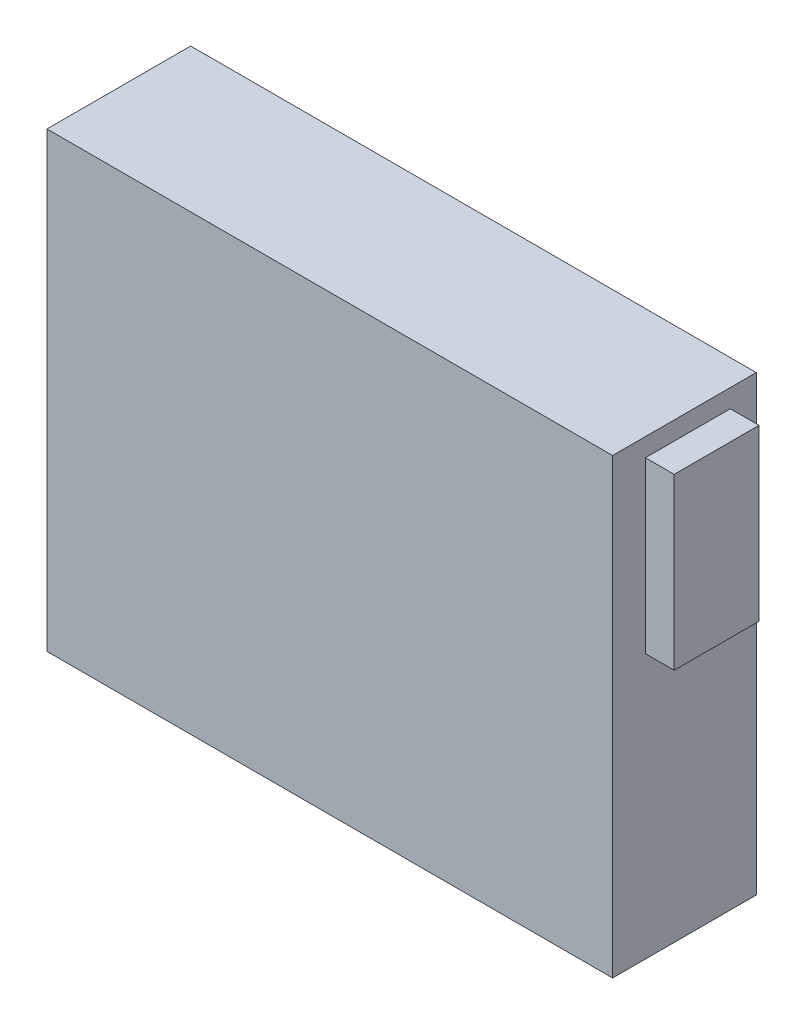
ISO-10303-21;
HEADER;
FILE_DESCRIPTION(('STEP AP214'),'2;1');
FILE_NAME('part.step','',(''),(''),'','','');
FILE_SCHEMA(('AUTOMOTIVE_DESIGN { 1 0 10303 214 1 1 1 1 }'));
ENDSEC;
DATA;
#1=APPLICATION_CONTEXT('core data for automotive mechanical design processes');
#2=APPLICATION_PROTOCOL_DEFINITION('international standard','automotive_design',2000,#1);
#3=PRODUCT_CONTEXT('',#1,'mechanical');
#4=PRODUCT('Part','Part','',(#3));
#5=PRODUCT_RELATED_PRODUCT_CATEGORY('part','',(#4));
#6=PRODUCT_DEFINITION_FORMATION('','',#4);
#7=PRODUCT_DEFINITION_CONTEXT('part definition',#1,'design');
#8=PRODUCT_DEFINITION('design','',#6,#7);
#9=PRODUCT_DEFINITION_SHAPE('','',#8);
#10=(LENGTH_UNIT() NAMED_UNIT(*) SI_UNIT(.MILLI.,.METRE.));
#11=(NAMED_UNIT(*) PLANE_ANGLE_UNIT() SI_UNIT($,.RADIAN.));
#12=(NAMED_UNIT(*) SI_UNIT($,.STERADIAN.) SOLID_ANGLE_UNIT());
#13=UNCERTAINTY_MEASURE_WITH_UNIT(LENGTH_MEASURE(1.E-05),#10,'distance_accuracy_value','');
#14=(GEOMETRIC_REPRESENTATION_CONTEXT(3) GLOBAL_UNCERTAINTY_ASSIGNED_CONTEXT((#13)) GLOBAL_UNIT_ASSIGNED_CONTEXT((#10,
#11,#12)) REPRESENTATION_CONTEXT('',''));
#15=CARTESIAN_POINT('',(0.,0.,0.));
#16=DIRECTION('',(0.,0.,1.));
#17=DIRECTION('',(1.,0.,0.));
#18=AXIS2_PLACEMENT_3D('',#15,#16,#17);
#19=CARTESIAN_POINT('',(-5.08,30.1830951092226,5.22936315422533));
#20=DIRECTION('',(0.,0.,1.));
#21=DIRECTION('',(0.,-1.,0.));
#22=AXIS2_PLACEMENT_3D('',#19,#20,#21);
#23=PLANE('',#22);
#24=DIRECTION('',(0.,-1.,0.));
#25=VECTOR('',#24,1.);
#26=CARTESIAN_POINT('',(0.,30.1830951092226,5.22936315422533));
#27=LINE('',#26,#25);
#28=CARTESIAN_POINT('',(0.,30.1830951092226,5.22936315422533));
#29=VERTEX_POINT('',#28);
#30=CARTESIAN_POINT('',(0.,0.1830951092226,5.22936315422534));
#31=VERTEX_POINT('',#30);
#32=EDGE_CURVE('E107',#29,#31,#27,.T.);
#33=ORIENTED_EDGE('',*,*,#32,.T.);
#34=DIRECTION('',(1.,0.,0.));
#35=VECTOR('',#34,1.);
#36=CARTESIAN_POINT('',(-5.08,0.1830951092226,5.22936315422534));
#37=LINE('',#36,#35);
#38=CARTESIAN_POINT('',(-5.08,0.1830951092226,5.22936315422534));
#39=VERTEX_POINT('',#38);
#40=EDGE_CURVE('E12',#39,#31,#37,.T.);
#41=ORIENTED_EDGE('',*,*,#40,.F.);
#42=DIRECTION('',(0.,-1.,0.));
#43=VECTOR('',#42,1.);
#44=CARTESIAN_POINT('',(-5.08,30.1830951092226,5.22936315422533));
#45=LINE('',#44,#43);
#46=CARTESIAN_POINT('',(-5.08,30.1830951092226,5.22936315422533));
#47=VERTEX_POINT('',#46);
#48=EDGE_CURVE('E95',#47,#39,#45,.T.);
#49=ORIENTED_EDGE('',*,*,#48,.F.);
#50=DIRECTION('',(1.,0.,0.));
#51=VECTOR('',#50,1.);
#52=CARTESIAN_POINT('',(-5.08,30.1830951092226,5.22936315422533));
#53=LINE('',#52,#51);
#54=EDGE_CURVE('E103',#47,#29,#53,.T.);
#55=ORIENTED_EDGE('',*,*,#54,.T.);
#56=EDGE_LOOP('',(#33,#41,#49,#55));
#57=FACE_BOUND('',#56,.T.);
#58=ADVANCED_FACE('F44',(#57),#23,.F.);
#59=CARTESIAN_POINT('',(-5.08,0.1830951092226,5.22936315422534));
#60=DIRECTION('',(0.,1.,0.));
#61=DIRECTION('',(0.,0.,1.));
#62=AXIS2_PLACEMENT_3D('',#59,#60,#61);
#63=PLANE('',#62);
#64=DIRECTION('',(0.,0.,1.));
#65=VECTOR('',#64,1.);
#66=CARTESIAN_POINT('',(0.,0.1830951092226,5.22936315422534));
#67=LINE('',#66,#65);
#68=CARTESIAN_POINT('',(0.,0.1830951092226,20.2293631542253));
#69=VERTEX_POINT('',#68);
#70=EDGE_CURVE('E99',#31,#69,#67,.T.);
#71=ORIENTED_EDGE('',*,*,#70,.T.);
#72=DIRECTION('',(1.,0.,0.));
#73=VECTOR('',#72,1.);
#74=CARTESIAN_POINT('',(-5.08,0.1830951092226,20.2293631542253));
#75=LINE('',#74,#73);
#76=CARTESIAN_POINT('',(-5.08,0.1830951092226,20.2293631542253));
#77=VERTEX_POINT('',#76);
#78=EDGE_CURVE('E52',#77,#69,#75,.T.);
#79=ORIENTED_EDGE('',*,*,#78,.F.);
#80=DIRECTION('',(0.,0.,1.));
#81=VECTOR('',#80,1.);
#82=CARTESIAN_POINT('',(-5.08,0.1830951092226,5.22936315422534));
#83=LINE('',#82,#81);
#84=EDGE_CURVE('E90',#39,#77,#83,.T.);
#85=ORIENTED_EDGE('',*,*,#84,.F.);
#86=ORIENTED_EDGE('',*,*,#40,.T.);
#87=EDGE_LOOP('',(#71,#79,#85,#86));
#88=FACE_BOUND('',#87,.T.);
#89=ADVANCED_FACE('F98',(#88),#63,.F.);
#90=CARTESIAN_POINT('',(-5.08,30.1830951092226,20.2293631542253));
#91=DIRECTION('',(0.,0.,-1.));
#92=DIRECTION('',(0.,1.,0.));
#93=AXIS2_PLACEMENT_3D('',#90,#91,#92);
#94=PLANE('',#93);
#95=DIRECTION('',(0.,1.,0.));
#96=VECTOR('',#95,1.);
#97=CARTESIAN_POINT('',(0.,30.1830951092226,20.2293631542253));
#98=LINE('',#97,#96);
#99=CARTESIAN_POINT('',(0.,30.1830951092226,20.2293631542253));
#100=VERTEX_POINT('',#99);
#101=EDGE_CURVE('E77',#69,#100,#98,.T.);
#102=ORIENTED_EDGE('',*,*,#101,.T.);
#103=DIRECTION('',(1.,0.,0.));
#104=VECTOR('',#103,1.);
#105=CARTESIAN_POINT('',(-5.08,30.1830951092226,20.2293631542253));
#106=LINE('',#105,#104);
#107=CARTESIAN_POINT('',(-5.08,30.1830951092226,20.2293631542253));
#108=VERTEX_POINT('',#107);
#109=EDGE_CURVE('E100',#108,#100,#106,.T.);
#110=ORIENTED_EDGE('',*,*,#109,.F.);
#111=DIRECTION('',(0.,1.,0.));
#112=VECTOR('',#111,1.);
#113=CARTESIAN_POINT('',(-5.08,30.1830951092226,20.2293631542253));
#114=LINE('',#113,#112);
#115=EDGE_CURVE('E93',#77,#108,#114,.T.);
#116=ORIENTED_EDGE('',*,*,#115,.F.);
#117=ORIENTED_EDGE('',*,*,#78,.T.);
#118=EDGE_LOOP('',(#102,#110,#116,#117));
#119=FACE_BOUND('',#118,.T.);
#120=ADVANCED_FACE('F101',(#119),#94,.F.);
#121=CARTESIAN_POINT('',(-5.08,30.1830951092226,5.22936315422533));
#122=DIRECTION('',(0.,-1.,0.));
#123=DIRECTION('',(0.,0.,-1.));
#124=AXIS2_PLACEMENT_3D('',#121,#122,#123);
#125=PLANE('',#124);
#126=DIRECTION('',(0.,0.,-1.));
#127=VECTOR('',#126,1.);
#128=CARTESIAN_POINT('',(0.,30.1830951092226,5.22936315422533));
#129=LINE('',#128,#127);
#130=EDGE_CURVE('E83',#100,#29,#129,.T.);
#131=ORIENTED_EDGE('',*,*,#130,.T.);
#132=ORIENTED_EDGE('',*,*,#54,.F.);
#133=DIRECTION('',(0.,0.,-1.));
#134=VECTOR('',#133,1.);
#135=CARTESIAN_POINT('',(-5.08,30.1830951092226,5.22936315422533));
#136=LINE('',#135,#134);
#137=EDGE_CURVE('E60',#108,#47,#136,.T.);
#138=ORIENTED_EDGE('',*,*,#137,.F.);
#139=ORIENTED_EDGE('',*,*,#109,.T.);
#140=EDGE_LOOP('',(#131,#132,#138,#139));
#141=FACE_BOUND('',#140,.T.);
#142=ADVANCED_FACE('F114',(#141),#125,.F.);
#143=CARTESIAN_POINT('',(-5.08,0.,0.));
#144=DIRECTION('',(-1.,0.,0.));
#145=DIRECTION('',(0.,0.,1.));
#146=AXIS2_PLACEMENT_3D('',#143,#144,#145);
#147=PLANE('',#146);
#148=ORIENTED_EDGE('',*,*,#48,.T.);
#149=ORIENTED_EDGE('',*,*,#84,.T.);
#150=ORIENTED_EDGE('',*,*,#115,.T.);
#151=ORIENTED_EDGE('',*,*,#137,.T.);
#152=EDGE_LOOP('',(#148,#149,#150,#151));
#153=FACE_BOUND('',#152,.T.);
#154=ADVANCED_FACE('F91',(#153),#147,.T.);
#155=CARTESIAN_POINT('',(0.,0.,0.));
#156=DIRECTION('',(-1.,0.,0.));
#157=DIRECTION('',(0.,0.,1.));
#158=AXIS2_PLACEMENT_3D('',#155,#156,#157);
#159=PLANE('',#158);
#160=ORIENTED_EDGE('',*,*,#32,.F.);
#161=ORIENTED_EDGE('',*,*,#130,.F.);
#162=ORIENTED_EDGE('',*,*,#101,.F.);
#163=ORIENTED_EDGE('',*,*,#70,.F.);
#164=EDGE_LOOP('',(#160,#161,#162,#163));
#165=FACE_BOUND('',#164,.T.);
#166=ADVANCED_FACE('F117',(#165),#159,.F.);
#167=CLOSED_SHELL('',(#58,#89,#120,#142,#154,#166));
#168=MANIFOLD_SOLID_BREP('B2',#167);
#169=CARTESIAN_POINT('',(105.08,76.7553631052221,19.5935642737339));
#170=DIRECTION('',(0.,0.,-1.));
#171=DIRECTION('',(0.,1.,0.));
#172=AXIS2_PLACEMENT_3D('',#169,#170,#171);
#173=PLANE('',#172);
#174=DIRECTION('',(0.,-1.,0.));
#175=VECTOR('',#174,1.);
#176=CARTESIAN_POINT('',(100.,76.7553631052221,19.5935642737339));
#177=LINE('',#176,#175);
#178=CARTESIAN_POINT('',(100.,76.7553631052221,19.5935642737339));
#179=VERTEX_POINT('',#178);
#180=CARTESIAN_POINT('',(100.,46.7553631052221,19.5935642737339));
#181=VERTEX_POINT('',#180);
#182=EDGE_CURVE('E240',#179,#181,#177,.T.);
#183=ORIENTED_EDGE('',*,*,#182,.T.);
#184=DIRECTION('',(-1.,0.,0.));
#185=VECTOR('',#184,1.);
#186=CARTESIAN_POINT('',(105.08,46.7553631052221,19.5935642737339));
#187=LINE('',#186,#185);
#188=CARTESIAN_POINT('',(105.08,46.7553631052221,19.5935642737339));
#189=VERTEX_POINT('',#188);
#190=EDGE_CURVE('E42',#189,#181,#187,.T.);
#191=ORIENTED_EDGE('',*,*,#190,.F.);
#192=DIRECTION('',(0.,-1.,0.));
#193=VECTOR('',#192,1.);
#194=CARTESIAN_POINT('',(105.08,76.7553631052221,19.5935642737339));
#195=LINE('',#194,#193);
#196=CARTESIAN_POINT('',(105.08,76.7553631052221,19.5935642737339));
#197=VERTEX_POINT('',#196);
#198=EDGE_CURVE('E228',#197,#189,#195,.T.);
#199=ORIENTED_EDGE('',*,*,#198,.F.);
#200=DIRECTION('',(-1.,0.,0.));
#201=VECTOR('',#200,1.);
#202=CARTESIAN_POINT('',(105.08,76.7553631052221,19.5935642737339));
#203=LINE('',#202,#201);
#204=EDGE_CURVE('E236',#197,#179,#203,.T.);
#205=ORIENTED_EDGE('',*,*,#204,.T.);
#206=EDGE_LOOP('',(#183,#191,#199,#205));
#207=FACE_BOUND('',#206,.T.);
#208=ADVANCED_FACE('F177',(#207),#173,.F.);
#209=CARTESIAN_POINT('',(105.08,46.7553631052221,19.5935642737339));
#210=DIRECTION('',(0.,1.,0.));
#211=DIRECTION('',(0.,0.,1.));
#212=AXIS2_PLACEMENT_3D('',#209,#210,#211);
#213=PLANE('',#212);
#214=DIRECTION('',(0.,0.,-1.));
#215=VECTOR('',#214,1.);
#216=CARTESIAN_POINT('',(100.,46.7553631052221,19.5935642737339));
#217=LINE('',#216,#215);
#218=CARTESIAN_POINT('',(100.,46.7553631052221,4.59356427373386));
#219=VERTEX_POINT('',#218);
#220=EDGE_CURVE('E232',#181,#219,#217,.T.);
#221=ORIENTED_EDGE('',*,*,#220,.T.);
#222=DIRECTION('',(-1.,0.,0.));
#223=VECTOR('',#222,1.);
#224=CARTESIAN_POINT('',(105.08,46.7553631052221,4.59356427373386));
#225=LINE('',#224,#223);
#226=CARTESIAN_POINT('',(105.08,46.7553631052221,4.59356427373386));
#227=VERTEX_POINT('',#226);
#228=EDGE_CURVE('E185',#227,#219,#225,.T.);
#229=ORIENTED_EDGE('',*,*,#228,.F.);
#230=DIRECTION('',(0.,0.,-1.));
#231=VECTOR('',#230,1.);
#232=CARTESIAN_POINT('',(105.08,46.7553631052221,19.5935642737339));
#233=LINE('',#232,#231);
#234=EDGE_CURVE('E223',#189,#227,#233,.T.);
#235=ORIENTED_EDGE('',*,*,#234,.F.);
#236=ORIENTED_EDGE('',*,*,#190,.T.);
#237=EDGE_LOOP('',(#221,#229,#235,#236));
#238=FACE_BOUND('',#237,.T.);
#239=ADVANCED_FACE('F231',(#238),#213,.F.);
#240=CARTESIAN_POINT('',(105.08,76.7553631052221,4.59356427373386));
#241=DIRECTION('',(0.,0.,1.));
#242=DIRECTION('',(0.,-1.,0.));
#243=AXIS2_PLACEMENT_3D('',#240,#241,#242);
#244=PLANE('',#243);
#245=DIRECTION('',(0.,1.,0.));
#246=VECTOR('',#245,1.);
#247=CARTESIAN_POINT('',(100.,76.7553631052221,4.59356427373386));
#248=LINE('',#247,#246);
#249=CARTESIAN_POINT('',(100.,76.7553631052221,4.59356427373386));
#250=VERTEX_POINT('',#249);
#251=EDGE_CURVE('E210',#219,#250,#248,.T.);
#252=ORIENTED_EDGE('',*,*,#251,.T.);
#253=DIRECTION('',(-1.,0.,0.));
#254=VECTOR('',#253,1.);
#255=CARTESIAN_POINT('',(105.08,76.7553631052221,4.59356427373386));
#256=LINE('',#255,#254);
#257=CARTESIAN_POINT('',(105.08,76.7553631052221,4.59356427373386));
#258=VERTEX_POINT('',#257);
#259=EDGE_CURVE('E233',#258,#250,#256,.T.);
#260=ORIENTED_EDGE('',*,*,#259,.F.);
#261=DIRECTION('',(0.,1.,0.));
#262=VECTOR('',#261,1.);
#263=CARTESIAN_POINT('',(105.08,76.7553631052221,4.59356427373386));
#264=LINE('',#263,#262);
#265=EDGE_CURVE('E226',#227,#258,#264,.T.);
#266=ORIENTED_EDGE('',*,*,#265,.F.);
#267=ORIENTED_EDGE('',*,*,#228,.T.);
#268=EDGE_LOOP('',(#252,#260,#266,#267));
#269=FACE_BOUND('',#268,.T.);
#270=ADVANCED_FACE('F234',(#269),#244,.F.);
#271=CARTESIAN_POINT('',(105.08,76.7553631052221,19.5935642737339));
#272=DIRECTION('',(0.,-1.,0.));
#273=DIRECTION('',(0.,0.,-1.));
#274=AXIS2_PLACEMENT_3D('',#271,#272,#273);
#275=PLANE('',#274);
#276=DIRECTION('',(0.,0.,1.));
#277=VECTOR('',#276,1.);
#278=CARTESIAN_POINT('',(100.,76.7553631052221,19.5935642737339));
#279=LINE('',#278,#277);
#280=EDGE_CURVE('E216',#250,#179,#279,.T.);
#281=ORIENTED_EDGE('',*,*,#280,.T.);
#282=ORIENTED_EDGE('',*,*,#204,.F.);
#283=DIRECTION('',(0.,0.,1.));
#284=VECTOR('',#283,1.);
#285=CARTESIAN_POINT('',(105.08,76.7553631052221,19.5935642737339));
#286=LINE('',#285,#284);
#287=EDGE_CURVE('E193',#258,#197,#286,.T.);
#288=ORIENTED_EDGE('',*,*,#287,.F.);
#289=ORIENTED_EDGE('',*,*,#259,.T.);
#290=EDGE_LOOP('',(#281,#282,#288,#289));
#291=FACE_BOUND('',#290,.T.);
#292=ADVANCED_FACE('F247',(#291),#275,.F.);
#293=CARTESIAN_POINT('',(105.08,0.,0.));
#294=DIRECTION('',(1.,0.,0.));
#295=DIRECTION('',(0.,0.,-1.));
#296=AXIS2_PLACEMENT_3D('',#293,#294,#295);
#297=PLANE('',#296);
#298=ORIENTED_EDGE('',*,*,#198,.T.);
#299=ORIENTED_EDGE('',*,*,#234,.T.);
#300=ORIENTED_EDGE('',*,*,#265,.T.);
#301=ORIENTED_EDGE('',*,*,#287,.T.);
#302=EDGE_LOOP('',(#298,#299,#300,#301));
#303=FACE_BOUND('',#302,.T.);
#304=ADVANCED_FACE('F224',(#303),#297,.T.);
#305=CARTESIAN_POINT('',(100.,0.,0.));
#306=DIRECTION('',(1.,0.,0.));
#307=DIRECTION('',(0.,0.,-1.));
#308=AXIS2_PLACEMENT_3D('',#305,#306,#307);
#309=PLANE('',#308);
#310=ORIENTED_EDGE('',*,*,#182,.F.);
#311=ORIENTED_EDGE('',*,*,#280,.F.);
#312=ORIENTED_EDGE('',*,*,#251,.F.);
#313=ORIENTED_EDGE('',*,*,#220,.F.);
#314=EDGE_LOOP('',(#310,#311,#312,#313));
#315=FACE_BOUND('',#314,.T.);
#316=ADVANCED_FACE('F250',(#315),#309,.F.);
#317=CLOSED_SHELL('',(#208,#239,#270,#292,#304,#316));
#318=MANIFOLD_SOLID_BREP('B6',#317);
#319=CARTESIAN_POINT('',(0.,0.,25.4));
#320=DIRECTION('',(1.,0.,0.));
#321=DIRECTION('',(0.,0.,-1.));
#322=AXIS2_PLACEMENT_3D('',#319,#320,#321);
#323=PLANE('',#322);
#324=DIRECTION('',(0.,0.,1.));
#325=VECTOR('',#324,1.);
#326=CARTESIAN_POINT('',(0.,0.1830951092226,5.22936315422534));
#327=LINE('',#326,#325);
#328=CARTESIAN_POINT('',(0.,0.1830951092226,5.22936315422534));
#329=VERTEX_POINT('',#328);
#330=CARTESIAN_POINT('',(0.,0.1830951092226,20.2293631542253));
#331=VERTEX_POINT('',#330);
#332=EDGE_CURVE('E418',#329,#331,#327,.T.);
#333=ORIENTED_EDGE('',*,*,#332,.F.);
#334=DIRECTION('',(0.,-1.,0.));
#335=VECTOR('',#334,1.);
#336=CARTESIAN_POINT('',(0.,30.1830951092226,5.22936315422533));
#337=LINE('',#336,#335);
#338=CARTESIAN_POINT('',(0.,30.1830951092226,5.22936315422533));
#339=VERTEX_POINT('',#338);
#340=EDGE_CURVE('E315',#339,#329,#337,.T.);
#341=ORIENTED_EDGE('',*,*,#340,.F.);
#342=DIRECTION('',(0.,0.,-1.));
#343=VECTOR('',#342,1.);
#344=CARTESIAN_POINT('',(0.,30.1830951092226,5.22936315422533));
#345=LINE('',#344,#343);
#346=CARTESIAN_POINT('',(0.,30.1830951092226,20.2293631542253));
#347=VERTEX_POINT('',#346);
#348=EDGE_CURVE('E409',#347,#339,#345,.T.);
#349=ORIENTED_EDGE('',*,*,#348,.F.);
#350=DIRECTION('',(0.,1.,0.));
#351=VECTOR('',#350,1.);
#352=CARTESIAN_POINT('',(0.,30.1830951092226,20.2293631542253));
#353=LINE('',#352,#351);
#354=EDGE_CURVE('E412',#331,#347,#353,.T.);
#355=ORIENTED_EDGE('',*,*,#354,.F.);
#356=EDGE_LOOP('',(#333,#341,#349,#355));
#357=FACE_BOUND('',#356,.T.);
#358=DIRECTION('',(0.,-1.,0.));
#359=VECTOR('',#358,1.);
#360=CARTESIAN_POINT('',(0.,0.,0.));
#361=LINE('',#360,#359);
#362=CARTESIAN_POINT('',(0.,80.,0.));
#363=VERTEX_POINT('',#362);
#364=CARTESIAN_POINT('',(0.,0.,0.));
#365=VERTEX_POINT('',#364);
#366=EDGE_CURVE('E452',#363,#365,#361,.T.);
#367=ORIENTED_EDGE('',*,*,#366,.T.);
#368=DIRECTION('',(0.,0.,-1.));
#369=VECTOR('',#368,1.);
#370=CARTESIAN_POINT('',(0.,0.,25.4));
#371=LINE('',#370,#369);
#372=CARTESIAN_POINT('',(0.,0.,25.4));
#373=VERTEX_POINT('',#372);
#374=EDGE_CURVE('E175',#373,#365,#371,.T.);
#375=ORIENTED_EDGE('',*,*,#374,.F.);
#376=DIRECTION('',(0.,-1.,0.));
#377=VECTOR('',#376,1.);
#378=CARTESIAN_POINT('',(0.,0.,25.4));
#379=LINE('',#378,#377);
#380=CARTESIAN_POINT('',(0.,80.,25.4));
#381=VERTEX_POINT('',#380);
#382=EDGE_CURVE('E458',#381,#373,#379,.T.);
#383=ORIENTED_EDGE('',*,*,#382,.F.);
#384=DIRECTION('',(0.,0.,-1.));
#385=VECTOR('',#384,1.);
#386=CARTESIAN_POINT('',(0.,80.,25.4));
#387=LINE('',#386,#385);
#388=EDGE_CURVE('E468',#381,#363,#387,.T.);
#389=ORIENTED_EDGE('',*,*,#388,.T.);
#390=EDGE_LOOP('',(#367,#375,#383,#389));
#391=FACE_BOUND('',#390,.T.);
#392=ADVANCED_FACE('F301',(#357,#391),#323,.F.);
#393=CARTESIAN_POINT('',(0.,0.,25.4));
#394=DIRECTION('',(0.,1.,0.));
#395=DIRECTION('',(0.,0.,1.));
#396=AXIS2_PLACEMENT_3D('',#393,#394,#395);
#397=PLANE('',#396);
#398=DIRECTION('',(1.,0.,0.));
#399=VECTOR('',#398,1.);
#400=CARTESIAN_POINT('',(0.,0.,0.));
#401=LINE('',#400,#399);
#402=CARTESIAN_POINT('',(100.,0.,0.));
#403=VERTEX_POINT('',#402);
#404=EDGE_CURVE('E471',#365,#403,#401,.T.);
#405=ORIENTED_EDGE('',*,*,#404,.T.);
#406=DIRECTION('',(0.,0.,-1.));
#407=VECTOR('',#406,1.);
#408=CARTESIAN_POINT('',(100.,0.,25.4));
#409=LINE('',#408,#407);
#410=CARTESIAN_POINT('',(100.,0.,25.4));
#411=VERTEX_POINT('',#410);
#412=EDGE_CURVE('E308',#411,#403,#409,.T.);
#413=ORIENTED_EDGE('',*,*,#412,.F.);
#414=DIRECTION('',(1.,0.,0.));
#415=VECTOR('',#414,1.);
#416=CARTESIAN_POINT('',(0.,0.,25.4));
#417=LINE('',#416,#415);
#418=EDGE_CURVE('E461',#373,#411,#417,.T.);
#419=ORIENTED_EDGE('',*,*,#418,.F.);
#420=ORIENTED_EDGE('',*,*,#374,.T.);
#421=EDGE_LOOP('',(#405,#413,#419,#420));
#422=FACE_BOUND('',#421,.T.);
#423=ADVANCED_FACE('F501',(#422),#397,.F.);
#424=CARTESIAN_POINT('',(100.,0.,25.4));
#425=DIRECTION('',(-1.,0.,0.));
#426=DIRECTION('',(0.,0.,1.));
#427=AXIS2_PLACEMENT_3D('',#424,#425,#426);
#428=PLANE('',#427);
#429=DIRECTION('',(0.,0.,-1.));
#430=VECTOR('',#429,1.);
#431=CARTESIAN_POINT('',(100.,46.7553631052221,19.5935642737339));
#432=LINE('',#431,#430);
#433=CARTESIAN_POINT('',(100.,46.7553631052221,19.5935642737339));
#434=VERTEX_POINT('',#433);
#435=CARTESIAN_POINT('',(100.,46.7553631052221,4.59356427373386));
#436=VERTEX_POINT('',#435);
#437=EDGE_CURVE('E442',#434,#436,#432,.T.);
#438=ORIENTED_EDGE('',*,*,#437,.F.);
#439=DIRECTION('',(0.,-1.,0.));
#440=VECTOR('',#439,1.);
#441=CARTESIAN_POINT('',(100.,76.7553631052221,19.5935642737339));
#442=LINE('',#441,#440);
#443=CARTESIAN_POINT('',(100.,76.7553631052221,19.5935642737339));
#444=VERTEX_POINT('',#443);
#445=EDGE_CURVE('E323',#444,#434,#442,.T.);
#446=ORIENTED_EDGE('',*,*,#445,.F.);
#447=DIRECTION('',(0.,0.,1.));
#448=VECTOR('',#447,1.);
#449=CARTESIAN_POINT('',(100.,76.7553631052221,19.5935642737339));
#450=LINE('',#449,#448);
#451=CARTESIAN_POINT('',(100.,76.7553631052221,4.59356427373386));
#452=VERTEX_POINT('',#451);
#453=EDGE_CURVE('E431',#452,#444,#450,.T.);
#454=ORIENTED_EDGE('',*,*,#453,.F.);
#455=DIRECTION('',(0.,1.,0.));
#456=VECTOR('',#455,1.);
#457=CARTESIAN_POINT('',(100.,76.7553631052221,4.59356427373386));
#458=LINE('',#457,#456);
#459=EDGE_CURVE('E445',#436,#452,#458,.T.);
#460=ORIENTED_EDGE('',*,*,#459,.F.);
#461=EDGE_LOOP('',(#438,#446,#454,#460));
#462=FACE_BOUND('',#461,.T.);
#463=DIRECTION('',(0.,1.,0.));
#464=VECTOR('',#463,1.);
#465=CARTESIAN_POINT('',(100.,0.,0.));
#466=LINE('',#465,#464);
#467=CARTESIAN_POINT('',(100.,80.,0.));
#468=VERTEX_POINT('',#467);
#469=EDGE_CURVE('E473',#403,#468,#466,.T.);
#470=ORIENTED_EDGE('',*,*,#469,.T.);
#471=DIRECTION('',(0.,0.,-1.));
#472=VECTOR('',#471,1.);
#473=CARTESIAN_POINT('',(100.,80.,25.4));
#474=LINE('',#473,#472);
#475=CARTESIAN_POINT('',(100.,80.,25.4));
#476=VERTEX_POINT('',#475);
#477=EDGE_CURVE('E478',#476,#468,#474,.T.);
#478=ORIENTED_EDGE('',*,*,#477,.F.);
#479=DIRECTION('',(0.,1.,0.));
#480=VECTOR('',#479,1.);
#481=CARTESIAN_POINT('',(100.,0.,25.4));
#482=LINE('',#481,#480);
#483=EDGE_CURVE('E464',#411,#476,#482,.T.);
#484=ORIENTED_EDGE('',*,*,#483,.F.);
#485=ORIENTED_EDGE('',*,*,#412,.T.);
#486=EDGE_LOOP('',(#470,#478,#484,#485));
#487=FACE_BOUND('',#486,.T.);
#488=ADVANCED_FACE('F485',(#462,#487),#428,.F.);
#489=CARTESIAN_POINT('',(0.,80.,25.4));
#490=DIRECTION('',(0.,-1.,0.));
#491=DIRECTION('',(0.,0.,-1.));
#492=AXIS2_PLACEMENT_3D('',#489,#490,#491);
#493=PLANE('',#492);
#494=DIRECTION('',(-1.,0.,0.));
#495=VECTOR('',#494,1.);
#496=CARTESIAN_POINT('',(0.,80.,0.));
#497=LINE('',#496,#495);
#498=EDGE_CURVE('E462',#468,#363,#497,.T.);
#499=ORIENTED_EDGE('',*,*,#498,.T.);
#500=ORIENTED_EDGE('',*,*,#388,.F.);
#501=DIRECTION('',(-1.,0.,0.));
#502=VECTOR('',#501,1.);
#503=CARTESIAN_POINT('',(0.,80.,25.4));
#504=LINE('',#503,#502);
#505=EDGE_CURVE('E466',#476,#381,#504,.T.);
#506=ORIENTED_EDGE('',*,*,#505,.F.);
#507=ORIENTED_EDGE('',*,*,#477,.T.);
#508=EDGE_LOOP('',(#499,#500,#506,#507));
#509=FACE_BOUND('',#508,.T.);
#510=ADVANCED_FACE('F494',(#509),#493,.F.);
#511=CARTESIAN_POINT('',(0.,0.,25.4));
#512=DIRECTION('',(0.,0.,-1.));
#513=DIRECTION('',(-1.,0.,0.));
#514=AXIS2_PLACEMENT_3D('',#511,#512,#513);
#515=PLANE('',#514);
#516=ORIENTED_EDGE('',*,*,#382,.T.);
#517=ORIENTED_EDGE('',*,*,#418,.T.);
#518=ORIENTED_EDGE('',*,*,#483,.T.);
#519=ORIENTED_EDGE('',*,*,#505,.T.);
#520=EDGE_LOOP('',(#516,#517,#518,#519));
#521=FACE_BOUND('',#520,.T.);
#522=ADVANCED_FACE('F500',(#521),#515,.F.);
#523=CARTESIAN_POINT('',(0.,0.,0.));
#524=DIRECTION('',(0.,0.,-1.));
#525=DIRECTION('',(-1.,0.,0.));
#526=AXIS2_PLACEMENT_3D('',#523,#524,#525);
#527=PLANE('',#526);
#528=ORIENTED_EDGE('',*,*,#366,.F.);
#529=ORIENTED_EDGE('',*,*,#498,.F.);
#530=ORIENTED_EDGE('',*,*,#469,.F.);
#531=ORIENTED_EDGE('',*,*,#404,.F.);
#532=EDGE_LOOP('',(#528,#529,#530,#531));
#533=FACE_BOUND('',#532,.T.);
#534=ADVANCED_FACE('F491',(#533),#527,.T.);
#535=CARTESIAN_POINT('',(89.078,76.7553631052221,19.5935642737339));
#536=DIRECTION('',(0.,0.,1.));
#537=DIRECTION('',(0.,-1.,0.));
#538=AXIS2_PLACEMENT_3D('',#535,#536,#537);
#539=PLANE('',#538);
#540=ORIENTED_EDGE('',*,*,#445,.T.);
#541=DIRECTION('',(1.,0.,0.));
#542=VECTOR('',#541,1.);
#543=CARTESIAN_POINT('',(89.078,46.7553631052221,19.5935642737339));
#544=LINE('',#543,#542);
#545=CARTESIAN_POINT('',(89.078,46.7553631052221,19.5935642737339));
#546=VERTEX_POINT('',#545);
#547=EDGE_CURVE('E440',#546,#434,#544,.T.);
#548=ORIENTED_EDGE('',*,*,#547,.F.);
#549=DIRECTION('',(0.,-1.,0.));
#550=VECTOR('',#549,1.);
#551=CARTESIAN_POINT('',(89.078,76.7553631052221,19.5935642737339));
#552=LINE('',#551,#550);
#553=CARTESIAN_POINT('',(89.078,76.7553631052221,19.5935642737339));
#554=VERTEX_POINT('',#553);
#555=EDGE_CURVE('E427',#554,#546,#552,.T.);
#556=ORIENTED_EDGE('',*,*,#555,.F.);
#557=DIRECTION('',(1.,0.,0.));
#558=VECTOR('',#557,1.);
#559=CARTESIAN_POINT('',(89.078,76.7553631052221,19.5935642737339));
#560=LINE('',#559,#558);
#561=EDGE_CURVE('E450',#554,#444,#560,.T.);
#562=ORIENTED_EDGE('',*,*,#561,.T.);
#563=EDGE_LOOP('',(#540,#548,#556,#562));
#564=FACE_BOUND('',#563,.T.);
#565=ADVANCED_FACE('F515',(#564),#539,.F.);
#566=CARTESIAN_POINT('',(89.078,76.7553631052221,19.5935642737339));
#567=DIRECTION('',(0.,1.,0.));
#568=DIRECTION('',(0.,0.,1.));
#569=AXIS2_PLACEMENT_3D('',#566,#567,#568);
#570=PLANE('',#569);
#571=ORIENTED_EDGE('',*,*,#453,.T.);
#572=ORIENTED_EDGE('',*,*,#561,.F.);
#573=DIRECTION('',(0.,0.,1.));
#574=VECTOR('',#573,1.);
#575=CARTESIAN_POINT('',(89.078,76.7553631052221,19.5935642737339));
#576=LINE('',#575,#574);
#577=CARTESIAN_POINT('',(89.078,76.7553631052221,4.59356427373386));
#578=VERTEX_POINT('',#577);
#579=EDGE_CURVE('E437',#578,#554,#576,.T.);
#580=ORIENTED_EDGE('',*,*,#579,.F.);
#581=DIRECTION('',(1.,0.,0.));
#582=VECTOR('',#581,1.);
#583=CARTESIAN_POINT('',(89.078,76.7553631052221,4.59356427373386));
#584=LINE('',#583,#582);
#585=EDGE_CURVE('E453',#578,#452,#584,.T.);
#586=ORIENTED_EDGE('',*,*,#585,.T.);
#587=EDGE_LOOP('',(#571,#572,#580,#586));
#588=FACE_BOUND('',#587,.T.);
#589=ADVANCED_FACE('F520',(#588),#570,.F.);
#590=CARTESIAN_POINT('',(89.078,76.7553631052221,4.59356427373386));
#591=DIRECTION('',(0.,0.,-1.));
#592=DIRECTION('',(0.,1.,0.));
#593=AXIS2_PLACEMENT_3D('',#590,#591,#592);
#594=PLANE('',#593);
#595=ORIENTED_EDGE('',*,*,#459,.T.);
#596=ORIENTED_EDGE('',*,*,#585,.F.);
#597=DIRECTION('',(0.,1.,0.));
#598=VECTOR('',#597,1.);
#599=CARTESIAN_POINT('',(89.078,76.7553631052221,4.59356427373386));
#600=LINE('',#599,#598);
#601=CARTESIAN_POINT('',(89.078,46.7553631052221,4.59356427373386));
#602=VERTEX_POINT('',#601);
#603=EDGE_CURVE('E434',#602,#578,#600,.T.);
#604=ORIENTED_EDGE('',*,*,#603,.F.);
#605=DIRECTION('',(1.,0.,0.));
#606=VECTOR('',#605,1.);
#607=CARTESIAN_POINT('',(89.078,46.7553631052221,4.59356427373386));
#608=LINE('',#607,#606);
#609=EDGE_CURVE('E455',#602,#436,#608,.T.);
#610=ORIENTED_EDGE('',*,*,#609,.T.);
#611=EDGE_LOOP('',(#595,#596,#604,#610));
#612=FACE_BOUND('',#611,.T.);
#613=ADVANCED_FACE('F525',(#612),#594,.F.);
#614=CARTESIAN_POINT('',(89.078,46.7553631052221,19.5935642737339));
#615=DIRECTION('',(0.,-1.,0.));
#616=DIRECTION('',(0.,0.,-1.));
#617=AXIS2_PLACEMENT_3D('',#614,#615,#616);
#618=PLANE('',#617);
#619=ORIENTED_EDGE('',*,*,#437,.T.);
#620=ORIENTED_EDGE('',*,*,#609,.F.);
#621=DIRECTION('',(0.,0.,-1.));
#622=VECTOR('',#621,1.);
#623=CARTESIAN_POINT('',(89.078,46.7553631052221,19.5935642737339));
#624=LINE('',#623,#622);
#625=EDGE_CURVE('E430',#546,#602,#624,.T.);
#626=ORIENTED_EDGE('',*,*,#625,.F.);
#627=ORIENTED_EDGE('',*,*,#547,.T.);
#628=EDGE_LOOP('',(#619,#620,#626,#627));
#629=FACE_BOUND('',#628,.T.);
#630=ADVANCED_FACE('F521',(#629),#618,.F.);
#631=CARTESIAN_POINT('',(89.078,0.,0.));
#632=DIRECTION('',(1.,0.,0.));
#633=DIRECTION('',(0.,0.,-1.));
#634=AXIS2_PLACEMENT_3D('',#631,#632,#633);
#635=PLANE('',#634);
#636=ORIENTED_EDGE('',*,*,#555,.T.);
#637=ORIENTED_EDGE('',*,*,#625,.T.);
#638=ORIENTED_EDGE('',*,*,#603,.T.);
#639=ORIENTED_EDGE('',*,*,#579,.T.);
#640=EDGE_LOOP('',(#636,#637,#638,#639));
#641=FACE_BOUND('',#640,.T.);
#642=ADVANCED_FACE('F524',(#641),#635,.T.);
#643=CARTESIAN_POINT('',(10.922,30.1830951092226,5.22936315422533));
#644=DIRECTION('',(0.,0.,-1.));
#645=DIRECTION('',(0.,1.,0.));
#646=AXIS2_PLACEMENT_3D('',#643,#644,#645);
#647=PLANE('',#646);
#648=ORIENTED_EDGE('',*,*,#340,.T.);
#649=DIRECTION('',(-1.,0.,0.));
#650=VECTOR('',#649,1.);
#651=CARTESIAN_POINT('',(10.922,0.1830951092226,5.22936315422534));
#652=LINE('',#651,#650);
#653=CARTESIAN_POINT('',(10.922,0.1830951092226,5.22936315422534));
#654=VERTEX_POINT('',#653);
#655=EDGE_CURVE('E387',#654,#329,#652,.T.);
#656=ORIENTED_EDGE('',*,*,#655,.F.);
#657=DIRECTION('',(0.,-1.,0.));
#658=VECTOR('',#657,1.);
#659=CARTESIAN_POINT('',(10.922,30.1830951092226,5.22936315422533));
#660=LINE('',#659,#658);
#661=CARTESIAN_POINT('',(10.922,30.1830951092226,5.22936315422533));
#662=VERTEX_POINT('',#661);
#663=EDGE_CURVE('E391',#662,#654,#660,.T.);
#664=ORIENTED_EDGE('',*,*,#663,.F.);
#665=DIRECTION('',(-1.,0.,0.));
#666=VECTOR('',#665,1.);
#667=CARTESIAN_POINT('',(10.922,30.1830951092226,5.22936315422533));
#668=LINE('',#667,#666);
#669=EDGE_CURVE('E422',#662,#339,#668,.T.);
#670=ORIENTED_EDGE('',*,*,#669,.T.);
#671=EDGE_LOOP('',(#648,#656,#664,#670));
#672=FACE_BOUND('',#671,.T.);
#673=ADVANCED_FACE('F389',(#672),#647,.F.);
#674=CARTESIAN_POINT('',(10.922,30.1830951092226,5.22936315422533));
#675=DIRECTION('',(0.,1.,0.));
#676=DIRECTION('',(0.,0.,1.));
#677=AXIS2_PLACEMENT_3D('',#674,#675,#676);
#678=PLANE('',#677);
#679=ORIENTED_EDGE('',*,*,#348,.T.);
#680=ORIENTED_EDGE('',*,*,#669,.F.);
#681=DIRECTION('',(0.,0.,-1.));
#682=VECTOR('',#681,1.);
#683=CARTESIAN_POINT('',(10.922,30.1830951092226,5.22936315422533));
#684=LINE('',#683,#682);
#685=CARTESIAN_POINT('',(10.922,30.1830951092226,20.2293631542253));
#686=VERTEX_POINT('',#685);
#687=EDGE_CURVE('E397',#686,#662,#684,.T.);
#688=ORIENTED_EDGE('',*,*,#687,.F.);
#689=DIRECTION('',(-1.,0.,0.));
#690=VECTOR('',#689,1.);
#691=CARTESIAN_POINT('',(10.922,30.1830951092226,20.2293631542253));
#692=LINE('',#691,#690);
#693=EDGE_CURVE('E424',#686,#347,#692,.T.);
#694=ORIENTED_EDGE('',*,*,#693,.T.);
#695=EDGE_LOOP('',(#679,#680,#688,#694));
#696=FACE_BOUND('',#695,.T.);
#697=ADVANCED_FACE('F538',(#696),#678,.F.);
#698=CARTESIAN_POINT('',(10.922,30.1830951092226,20.2293631542253));
#699=DIRECTION('',(0.,0.,1.));
#700=DIRECTION('',(0.,-1.,0.));
#701=AXIS2_PLACEMENT_3D('',#698,#699,#700);
#702=PLANE('',#701);
#703=ORIENTED_EDGE('',*,*,#354,.T.);
#704=ORIENTED_EDGE('',*,*,#693,.F.);
#705=DIRECTION('',(0.,1.,0.));
#706=VECTOR('',#705,1.);
#707=CARTESIAN_POINT('',(10.922,30.1830951092226,20.2293631542253));
#708=LINE('',#707,#706);
#709=CARTESIAN_POINT('',(10.922,0.1830951092226,20.2293631542253));
#710=VERTEX_POINT('',#709);
#711=EDGE_CURVE('E405',#710,#686,#708,.T.);
#712=ORIENTED_EDGE('',*,*,#711,.F.);
#713=DIRECTION('',(-1.,0.,0.));
#714=VECTOR('',#713,1.);
#715=CARTESIAN_POINT('',(10.922,0.1830951092226,20.2293631542253));
#716=LINE('',#715,#714);
#717=EDGE_CURVE('E396',#710,#331,#716,.T.);
#718=ORIENTED_EDGE('',*,*,#717,.T.);
#719=EDGE_LOOP('',(#703,#704,#712,#718));
#720=FACE_BOUND('',#719,.T.);
#721=ADVANCED_FACE('F541',(#720),#702,.F.);
#722=CARTESIAN_POINT('',(10.922,0.1830951092226,5.22936315422534));
#723=DIRECTION('',(0.,-1.,0.));
#724=DIRECTION('',(0.,0.,-1.));
#725=AXIS2_PLACEMENT_3D('',#722,#723,#724);
#726=PLANE('',#725);
#727=ORIENTED_EDGE('',*,*,#332,.T.);
#728=ORIENTED_EDGE('',*,*,#717,.F.);
#729=DIRECTION('',(0.,0.,1.));
#730=VECTOR('',#729,1.);
#731=CARTESIAN_POINT('',(10.922,0.1830951092226,5.22936315422534));
#732=LINE('',#731,#730);
#733=EDGE_CURVE('E400',#654,#710,#732,.T.);
#734=ORIENTED_EDGE('',*,*,#733,.F.);
#735=ORIENTED_EDGE('',*,*,#655,.T.);
#736=EDGE_LOOP('',(#727,#728,#734,#735));
#737=FACE_BOUND('',#736,.T.);
#738=ADVANCED_FACE('F401',(#737),#726,.F.);
#739=CARTESIAN_POINT('',(10.922,0.,0.));
#740=DIRECTION('',(-1.,0.,0.));
#741=DIRECTION('',(0.,0.,1.));
#742=AXIS2_PLACEMENT_3D('',#739,#740,#741);
#743=PLANE('',#742);
#744=ORIENTED_EDGE('',*,*,#663,.T.);
#745=ORIENTED_EDGE('',*,*,#733,.T.);
#746=ORIENTED_EDGE('',*,*,#711,.T.);
#747=ORIENTED_EDGE('',*,*,#687,.T.);
#748=EDGE_LOOP('',(#744,#745,#746,#747));
#749=FACE_BOUND('',#748,.T.);
#750=ADVANCED_FACE('F407',(#749),#743,.T.);
#751=CLOSED_SHELL('',(#392,#423,#488,#510,#522,#534,#565,#589,#613,#630,#642,#673,#697,#721,
#738,#750));
#752=MANIFOLD_SOLID_BREP('B36',#751);
#753=ADVANCED_BREP_SHAPE_REPRESENTATION('',(#18,#168,#318,#752),#14);
#754=SHAPE_DEFINITION_REPRESENTATION(#9,#753);
ENDSEC;
END-ISO-10303-21;
